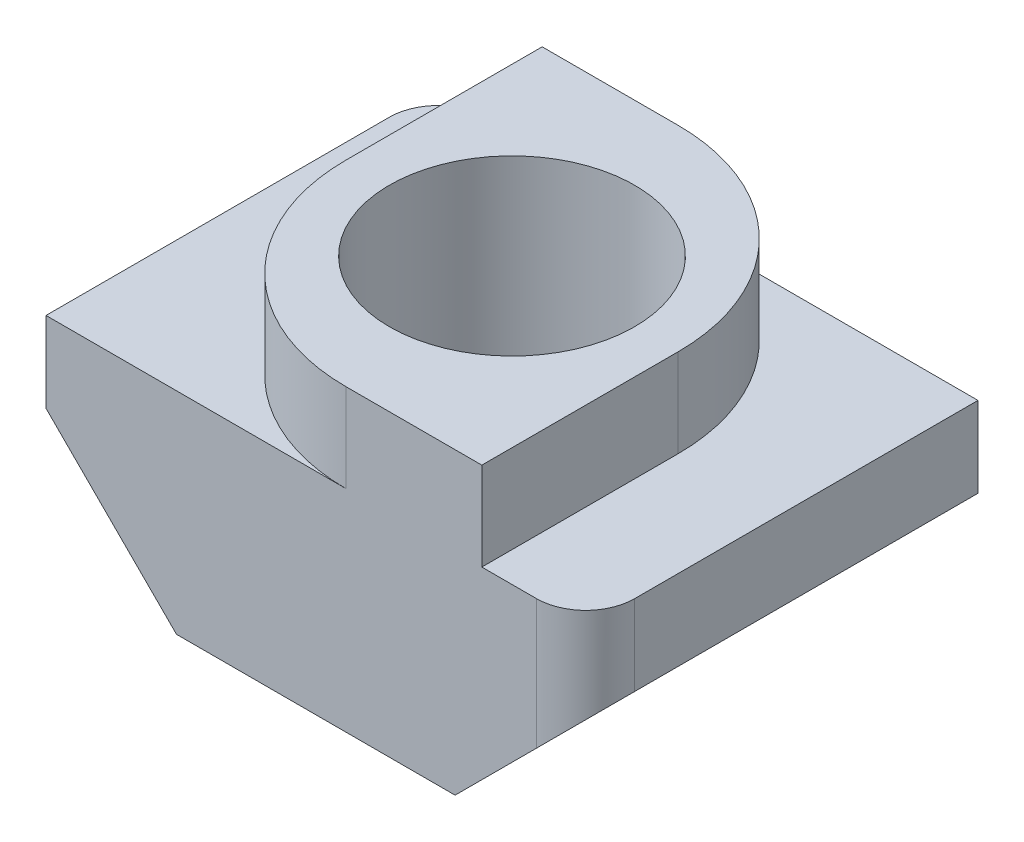
ISO-10303-21;
HEADER;
FILE_DESCRIPTION(('STEP AP214'),'2;1');
FILE_NAME('part.step','',(''),(''),'','','');
FILE_SCHEMA(('AUTOMOTIVE_DESIGN { 1 0 10303 214 1 1 1 1 }'));
ENDSEC;
DATA;
#1=APPLICATION_CONTEXT('core data for automotive mechanical design processes');
#2=APPLICATION_PROTOCOL_DEFINITION('international standard','automotive_design',2000,#1);
#3=PRODUCT_CONTEXT('',#1,'mechanical');
#4=PRODUCT('Part','Part','',(#3));
#5=PRODUCT_RELATED_PRODUCT_CATEGORY('part','',(#4));
#6=PRODUCT_DEFINITION_FORMATION('','',#4);
#7=PRODUCT_DEFINITION_CONTEXT('part definition',#1,'design');
#8=PRODUCT_DEFINITION('design','',#6,#7);
#9=PRODUCT_DEFINITION_SHAPE('','',#8);
#10=(LENGTH_UNIT() NAMED_UNIT(*) SI_UNIT(.MILLI.,.METRE.));
#11=(NAMED_UNIT(*) PLANE_ANGLE_UNIT() SI_UNIT($,.RADIAN.));
#12=(NAMED_UNIT(*) SI_UNIT($,.STERADIAN.) SOLID_ANGLE_UNIT());
#13=UNCERTAINTY_MEASURE_WITH_UNIT(LENGTH_MEASURE(1.E-05),#10,'distance_accuracy_value','');
#14=(GEOMETRIC_REPRESENTATION_CONTEXT(3) GLOBAL_UNCERTAINTY_ASSIGNED_CONTEXT((#13)) GLOBAL_UNIT_ASSIGNED_CONTEXT((#10,
#11,#12)) REPRESENTATION_CONTEXT('',''));
#15=CARTESIAN_POINT('',(0.,0.,0.));
#16=DIRECTION('',(0.,0.,1.));
#17=DIRECTION('',(1.,0.,0.));
#18=AXIS2_PLACEMENT_3D('',#15,#16,#17);
#19=CARTESIAN_POINT('',(0.,4.3,0.));
#20=DIRECTION('',(0.,-1.,0.));
#21=DIRECTION('',(0.,0.,-1.));
#22=AXIS2_PLACEMENT_3D('',#19,#20,#21);
#23=PLANE('',#22);
#24=DIRECTION('',(1.,0.,0.));
#25=VECTOR('',#24,1.);
#26=CARTESIAN_POINT('',(-5.5,4.3,4.));
#27=LINE('',#26,#25);
#28=CARTESIAN_POINT('',(3.385,4.3,4.));
#29=VERTEX_POINT('',#28);
#30=CARTESIAN_POINT('',(4.5,4.3,4.));
#31=VERTEX_POINT('',#30);
#32=EDGE_CURVE('E256',#29,#31,#27,.T.);
#33=ORIENTED_EDGE('',*,*,#32,.T.);
#34=CARTESIAN_POINT('',(4.5,4.3,3.));
#35=DIRECTION('',(0.,-1.,0.));
#36=DIRECTION('',(0.,0.,-1.));
#37=AXIS2_PLACEMENT_3D('',#34,#35,#36);
#38=CIRCLE('',#37,1.);
#39=CARTESIAN_POINT('',(5.5,4.3,3.));
#40=VERTEX_POINT('',#39);
#41=EDGE_CURVE('E204',#31,#40,#38,.F.);
#42=ORIENTED_EDGE('',*,*,#41,.T.);
#43=DIRECTION('',(0.,0.,-1.));
#44=VECTOR('',#43,1.);
#45=CARTESIAN_POINT('',(5.5,4.3,4.));
#46=LINE('',#45,#44);
#47=CARTESIAN_POINT('',(5.5,4.3,-4.));
#48=VERTEX_POINT('',#47);
#49=EDGE_CURVE('E234',#40,#48,#46,.T.);
#50=ORIENTED_EDGE('',*,*,#49,.T.);
#51=DIRECTION('',(-1.,0.,0.));
#52=VECTOR('',#51,1.);
#53=CARTESIAN_POINT('',(-5.5,4.3,-4.));
#54=LINE('',#53,#52);
#55=CARTESIAN_POINT('',(-0.615,4.3,-4.));
#56=VERTEX_POINT('',#55);
#57=EDGE_CURVE('E244',#48,#56,#54,.T.);
#58=ORIENTED_EDGE('',*,*,#57,.T.);
#59=CARTESIAN_POINT('',(-0.615,4.3,0.));
#60=DIRECTION('',(0.,-1.,0.));
#61=DIRECTION('',(0.,0.,-1.));
#62=AXIS2_PLACEMENT_3D('',#59,#60,#61);
#63=CIRCLE('',#62,4.);
#64=CARTESIAN_POINT('',(3.385,4.3,0.));
#65=VERTEX_POINT('',#64);
#66=EDGE_CURVE('E193',#56,#65,#63,.T.);
#67=ORIENTED_EDGE('',*,*,#66,.T.);
#68=DIRECTION('',(0.,0.,-1.));
#69=VECTOR('',#68,1.);
#70=CARTESIAN_POINT('',(3.385,4.3,4.));
#71=LINE('',#70,#69);
#72=EDGE_CURVE('E170',#29,#65,#71,.T.);
#73=ORIENTED_EDGE('',*,*,#72,.F.);
#74=EDGE_LOOP('',(#33,#42,#50,#58,#67,#73));
#75=FACE_BOUND('',#74,.T.);
#76=ADVANCED_FACE('F33',(#75),#23,.F.);
#77=CARTESIAN_POINT('',(-3.385,4.3,-4.));
#78=VERTEX_POINT('',#77);
#79=CARTESIAN_POINT('',(-4.5,4.3,-4.));
#80=VERTEX_POINT('',#79);
#81=EDGE_CURVE('E151',#78,#80,#54,.T.);
#82=ORIENTED_EDGE('',*,*,#81,.T.);
#83=CARTESIAN_POINT('',(-4.5,4.3,-3.));
#84=DIRECTION('',(0.,-1.,0.));
#85=DIRECTION('',(0.,0.,-1.));
#86=AXIS2_PLACEMENT_3D('',#83,#84,#85);
#87=CIRCLE('',#86,1.);
#88=CARTESIAN_POINT('',(-5.5,4.3,-3.));
#89=VERTEX_POINT('',#88);
#90=EDGE_CURVE('E11',#80,#89,#87,.F.);
#91=ORIENTED_EDGE('',*,*,#90,.T.);
#92=DIRECTION('',(0.,0.,1.));
#93=VECTOR('',#92,1.);
#94=CARTESIAN_POINT('',(-5.5,4.3,4.));
#95=LINE('',#94,#93);
#96=CARTESIAN_POINT('',(-5.5,4.3,4.));
#97=VERTEX_POINT('',#96);
#98=EDGE_CURVE('E216',#89,#97,#95,.T.);
#99=ORIENTED_EDGE('',*,*,#98,.T.);
#100=CARTESIAN_POINT('',(0.615,4.3,4.));
#101=VERTEX_POINT('',#100);
#102=EDGE_CURVE('E250',#97,#101,#27,.T.);
#103=ORIENTED_EDGE('',*,*,#102,.T.);
#104=CARTESIAN_POINT('',(0.615,4.3,0.));
#105=DIRECTION('',(0.,-1.,0.));
#106=DIRECTION('',(0.,0.,-1.));
#107=AXIS2_PLACEMENT_3D('',#104,#105,#106);
#108=CIRCLE('',#107,4.);
#109=CARTESIAN_POINT('',(-3.385,4.3,0.));
#110=VERTEX_POINT('',#109);
#111=EDGE_CURVE('E195',#101,#110,#108,.T.);
#112=ORIENTED_EDGE('',*,*,#111,.T.);
#113=DIRECTION('',(0.,0.,1.));
#114=VECTOR('',#113,1.);
#115=CARTESIAN_POINT('',(-3.385,4.3,4.));
#116=LINE('',#115,#114);
#117=EDGE_CURVE('E174',#78,#110,#116,.T.);
#118=ORIENTED_EDGE('',*,*,#117,.F.);
#119=EDGE_LOOP('',(#82,#91,#99,#103,#112,#118));
#120=FACE_BOUND('',#119,.T.);
#121=ADVANCED_FACE('F265',(#120),#23,.F.);
#122=CARTESIAN_POINT('',(0.,0.,0.));
#123=DIRECTION('',(0.,-1.,0.));
#124=DIRECTION('',(0.,0.,-1.));
#125=AXIS2_PLACEMENT_3D('',#122,#123,#124);
#126=PLANE('',#125);
#127=DIRECTION('',(0.,0.,1.));
#128=VECTOR('',#127,1.);
#129=CARTESIAN_POINT('',(2.84000000000001,0.,-4.));
#130=LINE('',#129,#128);
#131=CARTESIAN_POINT('',(2.84000000000001,0.,-4.));
#132=VERTEX_POINT('',#131);
#133=CARTESIAN_POINT('',(2.84000000000001,0.,4.));
#134=VERTEX_POINT('',#133);
#135=EDGE_CURVE('E342',#132,#134,#130,.T.);
#136=ORIENTED_EDGE('',*,*,#135,.T.);
#137=DIRECTION('',(1.,0.,0.));
#138=VECTOR('',#137,1.);
#139=CARTESIAN_POINT('',(-5.5,0.,4.));
#140=LINE('',#139,#138);
#141=CARTESIAN_POINT('',(-2.84000000000001,0.,4.));
#142=VERTEX_POINT('',#141);
#143=EDGE_CURVE('E236',#142,#134,#140,.T.);
#144=ORIENTED_EDGE('',*,*,#143,.F.);
#145=DIRECTION('',(0.,0.,1.));
#146=VECTOR('',#145,1.);
#147=CARTESIAN_POINT('',(-2.84000000000001,0.,-4.));
#148=LINE('',#147,#146);
#149=CARTESIAN_POINT('',(-2.84000000000001,0.,-4.));
#150=VERTEX_POINT('',#149);
#151=EDGE_CURVE('E224',#150,#142,#148,.T.);
#152=ORIENTED_EDGE('',*,*,#151,.F.);
#153=DIRECTION('',(-1.,0.,0.));
#154=VECTOR('',#153,1.);
#155=CARTESIAN_POINT('',(-5.5,0.,-4.));
#156=LINE('',#155,#154);
#157=EDGE_CURVE('E227',#132,#150,#156,.T.);
#158=ORIENTED_EDGE('',*,*,#157,.F.);
#159=EDGE_LOOP('',(#136,#144,#152,#158));
#160=FACE_BOUND('',#159,.T.);
#161=CARTESIAN_POINT('',(0.,0.,0.));
#162=DIRECTION('',(0.,1.,0.));
#163=DIRECTION('',(0.,0.,1.));
#164=AXIS2_PLACEMENT_3D('',#161,#162,#163);
#165=CIRCLE('',#164,2.5);
#166=CARTESIAN_POINT('',(0.,0.,2.5));
#167=VERTEX_POINT('',#166);
#168=EDGE_CURVE('E223',#167,#167,#165,.T.);
#169=ORIENTED_EDGE('',*,*,#168,.T.);
#170=EDGE_LOOP('',(#169));
#171=FACE_BOUND('',#170,.T.);
#172=ADVANCED_FACE('F298',(#160,#171),#126,.T.);
#173=CARTESIAN_POINT('',(5.5,4.3,4.));
#174=DIRECTION('',(-1.,0.,0.));
#175=DIRECTION('',(0.,0.,1.));
#176=AXIS2_PLACEMENT_3D('',#173,#174,#175);
#177=PLANE('',#176);
#178=ORIENTED_EDGE('',*,*,#49,.F.);
#179=DIRECTION('',(0.,-1.,0.));
#180=VECTOR('',#179,1.);
#181=CARTESIAN_POINT('',(5.5,4.3,3.));
#182=LINE('',#181,#180);
#183=CARTESIAN_POINT('',(5.5,2.66,3.));
#184=VERTEX_POINT('',#183);
#185=EDGE_CURVE('E197',#40,#184,#182,.T.);
#186=ORIENTED_EDGE('',*,*,#185,.T.);
#187=DIRECTION('',(0.,0.,1.));
#188=VECTOR('',#187,1.);
#189=CARTESIAN_POINT('',(5.5,2.66,-4.));
#190=LINE('',#189,#188);
#191=CARTESIAN_POINT('',(5.5,2.66,-4.));
#192=VERTEX_POINT('',#191);
#193=EDGE_CURVE('E333',#192,#184,#190,.T.);
#194=ORIENTED_EDGE('',*,*,#193,.F.);
#195=DIRECTION('',(0.,-1.,0.));
#196=VECTOR('',#195,1.);
#197=CARTESIAN_POINT('',(5.5,4.3,-4.));
#198=LINE('',#197,#196);
#199=EDGE_CURVE('E184',#48,#192,#198,.T.);
#200=ORIENTED_EDGE('',*,*,#199,.F.);
#201=EDGE_LOOP('',(#178,#186,#194,#200));
#202=FACE_BOUND('',#201,.T.);
#203=ADVANCED_FACE('F304',(#202),#177,.F.);
#204=CARTESIAN_POINT('',(-5.5,4.3,-4.));
#205=DIRECTION('',(0.,0.,1.));
#206=DIRECTION('',(1.,0.,0.));
#207=AXIS2_PLACEMENT_3D('',#204,#205,#206);
#208=PLANE('',#207);
#209=DIRECTION('',(-0.707106781186546,0.707106781186549,0.));
#210=VECTOR('',#209,1.);
#211=CARTESIAN_POINT('',(-5.5,2.66,-4.));
#212=LINE('',#211,#210);
#213=CARTESIAN_POINT('',(-4.5,1.66,-4.));
#214=VERTEX_POINT('',#213);
#215=EDGE_CURVE('E229',#150,#214,#212,.T.);
#216=ORIENTED_EDGE('',*,*,#215,.T.);
#217=DIRECTION('',(0.,-1.,0.));
#218=VECTOR('',#217,1.);
#219=CARTESIAN_POINT('',(-4.5,4.3,-4.));
#220=LINE('',#219,#218);
#221=EDGE_CURVE('E41',#214,#80,#220,.F.);
#222=ORIENTED_EDGE('',*,*,#221,.T.);
#223=ORIENTED_EDGE('',*,*,#81,.F.);
#224=DIRECTION('',(0.,-1.,0.));
#225=VECTOR('',#224,1.);
#226=CARTESIAN_POINT('',(-3.385,6.1,-4.));
#227=LINE('',#226,#225);
#228=CARTESIAN_POINT('',(-3.385,6.1,-4.));
#229=VERTEX_POINT('',#228);
#230=EDGE_CURVE('E149',#229,#78,#227,.T.);
#231=ORIENTED_EDGE('',*,*,#230,.F.);
#232=DIRECTION('',(-1.,0.,0.));
#233=VECTOR('',#232,1.);
#234=CARTESIAN_POINT('',(-3.385,6.1,-4.));
#235=LINE('',#234,#233);
#236=CARTESIAN_POINT('',(-0.615,6.1,-4.));
#237=VERTEX_POINT('',#236);
#238=EDGE_CURVE('E134',#237,#229,#235,.T.);
#239=ORIENTED_EDGE('',*,*,#238,.F.);
#240=DIRECTION('',(0.,-1.,0.));
#241=VECTOR('',#240,1.);
#242=CARTESIAN_POINT('',(-0.615,4.3,-4.));
#243=LINE('',#242,#241);
#244=EDGE_CURVE('E181',#237,#56,#243,.T.);
#245=ORIENTED_EDGE('',*,*,#244,.T.);
#246=ORIENTED_EDGE('',*,*,#57,.F.);
#247=ORIENTED_EDGE('',*,*,#199,.T.);
#248=DIRECTION('',(-0.707106781186547,-0.707106781186548,0.));
#249=VECTOR('',#248,1.);
#250=CARTESIAN_POINT('',(5.5,2.66,-4.));
#251=LINE('',#250,#249);
#252=EDGE_CURVE('E335',#192,#132,#251,.T.);
#253=ORIENTED_EDGE('',*,*,#252,.T.);
#254=ORIENTED_EDGE('',*,*,#157,.T.);
#255=EDGE_LOOP('',(#216,#222,#223,#231,#239,#245,#246,#247,#253,#254));
#256=FACE_BOUND('',#255,.T.);
#257=ADVANCED_FACE('F150',(#256),#208,.F.);
#258=CARTESIAN_POINT('',(-5.5,4.3,4.));
#259=DIRECTION('',(1.,0.,0.));
#260=DIRECTION('',(0.,0.,-1.));
#261=AXIS2_PLACEMENT_3D('',#258,#259,#260);
#262=PLANE('',#261);
#263=ORIENTED_EDGE('',*,*,#98,.F.);
#264=DIRECTION('',(0.,-1.,0.));
#265=VECTOR('',#264,1.);
#266=CARTESIAN_POINT('',(-5.5,4.3,-3.));
#267=LINE('',#266,#265);
#268=CARTESIAN_POINT('',(-5.5,2.66,-3.));
#269=VERTEX_POINT('',#268);
#270=EDGE_CURVE('E206',#89,#269,#267,.T.);
#271=ORIENTED_EDGE('',*,*,#270,.T.);
#272=DIRECTION('',(0.,0.,1.));
#273=VECTOR('',#272,1.);
#274=CARTESIAN_POINT('',(-5.5,2.66,-4.));
#275=LINE('',#274,#273);
#276=CARTESIAN_POINT('',(-5.5,2.66,4.));
#277=VERTEX_POINT('',#276);
#278=EDGE_CURVE('E214',#269,#277,#275,.T.);
#279=ORIENTED_EDGE('',*,*,#278,.T.);
#280=DIRECTION('',(0.,-1.,0.));
#281=VECTOR('',#280,1.);
#282=CARTESIAN_POINT('',(-5.5,4.3,4.));
#283=LINE('',#282,#281);
#284=EDGE_CURVE('E248',#97,#277,#283,.T.);
#285=ORIENTED_EDGE('',*,*,#284,.F.);
#286=EDGE_LOOP('',(#263,#271,#279,#285));
#287=FACE_BOUND('',#286,.T.);
#288=ADVANCED_FACE('F212',(#287),#262,.F.);
#289=CARTESIAN_POINT('',(-5.5,4.3,4.));
#290=DIRECTION('',(0.,0.,-1.));
#291=DIRECTION('',(-1.,0.,0.));
#292=AXIS2_PLACEMENT_3D('',#289,#290,#291);
#293=PLANE('',#292);
#294=DIRECTION('',(-0.707106781186547,-0.707106781186548,0.));
#295=VECTOR('',#294,1.);
#296=CARTESIAN_POINT('',(5.5,2.66,4.));
#297=LINE('',#296,#295);
#298=CARTESIAN_POINT('',(4.5,1.66,4.));
#299=VERTEX_POINT('',#298);
#300=EDGE_CURVE('E154',#299,#134,#297,.T.);
#301=ORIENTED_EDGE('',*,*,#300,.F.);
#302=DIRECTION('',(0.,-1.,0.));
#303=VECTOR('',#302,1.);
#304=CARTESIAN_POINT('',(4.5,4.3,4.));
#305=LINE('',#304,#303);
#306=EDGE_CURVE('E202',#299,#31,#305,.F.);
#307=ORIENTED_EDGE('',*,*,#306,.T.);
#308=ORIENTED_EDGE('',*,*,#32,.F.);
#309=DIRECTION('',(0.,-1.,0.));
#310=VECTOR('',#309,1.);
#311=CARTESIAN_POINT('',(3.385,6.1,4.));
#312=LINE('',#311,#310);
#313=CARTESIAN_POINT('',(3.385,6.1,4.));
#314=VERTEX_POINT('',#313);
#315=EDGE_CURVE('E155',#314,#29,#312,.T.);
#316=ORIENTED_EDGE('',*,*,#315,.F.);
#317=DIRECTION('',(1.,0.,0.));
#318=VECTOR('',#317,1.);
#319=CARTESIAN_POINT('',(-3.385,6.1,4.));
#320=LINE('',#319,#318);
#321=CARTESIAN_POINT('',(0.615,6.1,4.));
#322=VERTEX_POINT('',#321);
#323=EDGE_CURVE('E160',#322,#314,#320,.T.);
#324=ORIENTED_EDGE('',*,*,#323,.F.);
#325=DIRECTION('',(0.,-1.,0.));
#326=VECTOR('',#325,1.);
#327=CARTESIAN_POINT('',(0.615,4.3,4.));
#328=LINE('',#327,#326);
#329=EDGE_CURVE('E189',#322,#101,#328,.T.);
#330=ORIENTED_EDGE('',*,*,#329,.T.);
#331=ORIENTED_EDGE('',*,*,#102,.F.);
#332=ORIENTED_EDGE('',*,*,#284,.T.);
#333=DIRECTION('',(-0.707106781186546,0.707106781186549,0.));
#334=VECTOR('',#333,1.);
#335=CARTESIAN_POINT('',(-5.5,2.66,4.));
#336=LINE('',#335,#334);
#337=EDGE_CURVE('E221',#142,#277,#336,.T.);
#338=ORIENTED_EDGE('',*,*,#337,.F.);
#339=ORIENTED_EDGE('',*,*,#143,.T.);
#340=EDGE_LOOP('',(#301,#307,#308,#316,#324,#330,#331,#332,#338,#339));
#341=FACE_BOUND('',#340,.T.);
#342=ADVANCED_FACE('F268',(#341),#293,.F.);
#343=CARTESIAN_POINT('',(0.,4.3,0.));
#344=DIRECTION('',(0.,-1.,0.));
#345=DIRECTION('',(0.,0.,-1.));
#346=AXIS2_PLACEMENT_3D('',#343,#344,#345);
#347=CYLINDRICAL_SURFACE('',#346,2.5);
#348=ORIENTED_EDGE('',*,*,#168,.F.);
#349=EDGE_LOOP('',(#348));
#350=FACE_BOUND('',#349,.T.);
#351=CARTESIAN_POINT('',(0.,6.1,0.));
#352=DIRECTION('',(0.,1.,0.));
#353=DIRECTION('',(0.,0.,1.));
#354=AXIS2_PLACEMENT_3D('',#351,#352,#353);
#355=CIRCLE('',#354,2.5);
#356=CARTESIAN_POINT('',(0.,6.1,2.5));
#357=VERTEX_POINT('',#356);
#358=EDGE_CURVE('E175',#357,#357,#355,.T.);
#359=ORIENTED_EDGE('',*,*,#358,.T.);
#360=EDGE_LOOP('',(#359));
#361=FACE_BOUND('',#360,.T.);
#362=ADVANCED_FACE('F279',(#350,#361),#347,.F.);
#363=CARTESIAN_POINT('',(-5.5,2.66,-4.));
#364=DIRECTION('',(0.707106781186549,0.707106781186546,0.));
#365=DIRECTION('',(-0.707106781186546,0.707106781186549,0.));
#366=AXIS2_PLACEMENT_3D('',#363,#364,#365);
#367=PLANE('',#366);
#368=ORIENTED_EDGE('',*,*,#278,.F.);
#369=CARTESIAN_POINT('',(-4.5,1.66,-3.));
#370=DIRECTION('',(0.707106781186549,0.707106781186546,0.));
#371=DIRECTION('',(0.707106781186546,-0.707106781186549,0.));
#372=AXIS2_PLACEMENT_3D('',#369,#370,#371);
#373=ELLIPSE('',#372,1.4142135623731,1.);
#374=EDGE_CURVE('E55',#269,#214,#373,.F.);
#375=ORIENTED_EDGE('',*,*,#374,.T.);
#376=ORIENTED_EDGE('',*,*,#215,.F.);
#377=ORIENTED_EDGE('',*,*,#151,.T.);
#378=ORIENTED_EDGE('',*,*,#337,.T.);
#379=EDGE_LOOP('',(#368,#375,#376,#377,#378));
#380=FACE_BOUND('',#379,.T.);
#381=ADVANCED_FACE('F219',(#380),#367,.F.);
#382=CARTESIAN_POINT('',(5.5,2.66,-4.));
#383=DIRECTION('',(-0.707106781186549,0.707106781186547,0.));
#384=DIRECTION('',(-0.707106781186547,-0.707106781186549,0.));
#385=AXIS2_PLACEMENT_3D('',#382,#383,#384);
#386=PLANE('',#385);
#387=ORIENTED_EDGE('',*,*,#193,.T.);
#388=CARTESIAN_POINT('',(4.5,1.66,3.));
#389=DIRECTION('',(-0.707106781186549,0.707106781186547,0.));
#390=DIRECTION('',(-0.707106781186547,-0.707106781186549,0.));
#391=AXIS2_PLACEMENT_3D('',#388,#389,#390);
#392=ELLIPSE('',#391,1.4142135623731,1.);
#393=EDGE_CURVE('E200',#184,#299,#392,.F.);
#394=ORIENTED_EDGE('',*,*,#393,.T.);
#395=ORIENTED_EDGE('',*,*,#300,.T.);
#396=ORIENTED_EDGE('',*,*,#135,.F.);
#397=ORIENTED_EDGE('',*,*,#252,.F.);
#398=EDGE_LOOP('',(#387,#394,#395,#396,#397));
#399=FACE_BOUND('',#398,.T.);
#400=ADVANCED_FACE('F282',(#399),#386,.F.);
#401=CARTESIAN_POINT('',(0.,6.1,0.));
#402=DIRECTION('',(0.,-1.,0.));
#403=DIRECTION('',(0.,0.,-1.));
#404=AXIS2_PLACEMENT_3D('',#401,#402,#403);
#405=PLANE('',#404);
#406=DIRECTION('',(0.,0.,-1.));
#407=VECTOR('',#406,1.);
#408=CARTESIAN_POINT('',(3.385,6.1,4.));
#409=LINE('',#408,#407);
#410=CARTESIAN_POINT('',(3.385,6.1,0.));
#411=VERTEX_POINT('',#410);
#412=EDGE_CURVE('E146',#314,#411,#409,.T.);
#413=ORIENTED_EDGE('',*,*,#412,.T.);
#414=CARTESIAN_POINT('',(-0.615,6.1,0.));
#415=DIRECTION('',(0.,-1.,0.));
#416=DIRECTION('',(0.,0.,-1.));
#417=AXIS2_PLACEMENT_3D('',#414,#415,#416);
#418=CIRCLE('',#417,4.);
#419=EDGE_CURVE('E143',#411,#237,#418,.F.);
#420=ORIENTED_EDGE('',*,*,#419,.T.);
#421=ORIENTED_EDGE('',*,*,#238,.T.);
#422=DIRECTION('',(0.,0.,1.));
#423=VECTOR('',#422,1.);
#424=CARTESIAN_POINT('',(-3.385,6.1,4.));
#425=LINE('',#424,#423);
#426=CARTESIAN_POINT('',(-3.385,6.1,0.));
#427=VERTEX_POINT('',#426);
#428=EDGE_CURVE('E140',#229,#427,#425,.T.);
#429=ORIENTED_EDGE('',*,*,#428,.T.);
#430=CARTESIAN_POINT('',(0.615,6.1,0.));
#431=DIRECTION('',(0.,-1.,0.));
#432=DIRECTION('',(0.,0.,-1.));
#433=AXIS2_PLACEMENT_3D('',#430,#431,#432);
#434=CIRCLE('',#433,4.);
#435=EDGE_CURVE('E186',#427,#322,#434,.F.);
#436=ORIENTED_EDGE('',*,*,#435,.T.);
#437=ORIENTED_EDGE('',*,*,#323,.T.);
#438=EDGE_LOOP('',(#413,#420,#421,#429,#436,#437));
#439=FACE_BOUND('',#438,.T.);
#440=ORIENTED_EDGE('',*,*,#358,.F.);
#441=EDGE_LOOP('',(#440));
#442=FACE_BOUND('',#441,.T.);
#443=ADVANCED_FACE('F137',(#439,#442),#405,.F.);
#444=CARTESIAN_POINT('',(3.385,6.1,4.));
#445=DIRECTION('',(-1.,0.,0.));
#446=DIRECTION('',(0.,0.,1.));
#447=AXIS2_PLACEMENT_3D('',#444,#445,#446);
#448=PLANE('',#447);
#449=ORIENTED_EDGE('',*,*,#72,.T.);
#450=DIRECTION('',(0.,-1.,0.));
#451=VECTOR('',#450,1.);
#452=CARTESIAN_POINT('',(3.385,6.1,0.));
#453=LINE('',#452,#451);
#454=EDGE_CURVE('E183',#65,#411,#453,.F.);
#455=ORIENTED_EDGE('',*,*,#454,.T.);
#456=ORIENTED_EDGE('',*,*,#412,.F.);
#457=ORIENTED_EDGE('',*,*,#315,.T.);
#458=EDGE_LOOP('',(#449,#455,#456,#457));
#459=FACE_BOUND('',#458,.T.);
#460=ADVANCED_FACE('F281',(#459),#448,.F.);
#461=CARTESIAN_POINT('',(-3.385,6.1,4.));
#462=DIRECTION('',(1.,0.,0.));
#463=DIRECTION('',(0.,0.,-1.));
#464=AXIS2_PLACEMENT_3D('',#461,#462,#463);
#465=PLANE('',#464);
#466=ORIENTED_EDGE('',*,*,#117,.T.);
#467=DIRECTION('',(0.,-1.,0.));
#468=VECTOR('',#467,1.);
#469=CARTESIAN_POINT('',(-3.385,6.1,0.));
#470=LINE('',#469,#468);
#471=EDGE_CURVE('E159',#110,#427,#470,.F.);
#472=ORIENTED_EDGE('',*,*,#471,.T.);
#473=ORIENTED_EDGE('',*,*,#428,.F.);
#474=ORIENTED_EDGE('',*,*,#230,.T.);
#475=EDGE_LOOP('',(#466,#472,#473,#474));
#476=FACE_BOUND('',#475,.T.);
#477=ADVANCED_FACE('F157',(#476),#465,.F.);
#478=CARTESIAN_POINT('',(-0.615,4.3,0.));
#479=DIRECTION('',(0.,-1.,0.));
#480=DIRECTION('',(0.,0.,-1.));
#481=AXIS2_PLACEMENT_3D('',#478,#479,#480);
#482=CYLINDRICAL_SURFACE('',#481,4.);
#483=ORIENTED_EDGE('',*,*,#419,.F.);
#484=ORIENTED_EDGE('',*,*,#454,.F.);
#485=ORIENTED_EDGE('',*,*,#66,.F.);
#486=ORIENTED_EDGE('',*,*,#244,.F.);
#487=EDGE_LOOP('',(#483,#484,#485,#486));
#488=FACE_BOUND('',#487,.T.);
#489=ADVANCED_FACE('F315',(#488),#482,.T.);
#490=CARTESIAN_POINT('',(0.615,4.3,0.));
#491=DIRECTION('',(0.,-1.,0.));
#492=DIRECTION('',(0.,0.,-1.));
#493=AXIS2_PLACEMENT_3D('',#490,#491,#492);
#494=CYLINDRICAL_SURFACE('',#493,4.);
#495=ORIENTED_EDGE('',*,*,#435,.F.);
#496=ORIENTED_EDGE('',*,*,#471,.F.);
#497=ORIENTED_EDGE('',*,*,#111,.F.);
#498=ORIENTED_EDGE('',*,*,#329,.F.);
#499=EDGE_LOOP('',(#495,#496,#497,#498));
#500=FACE_BOUND('',#499,.T.);
#501=ADVANCED_FACE('F273',(#500),#494,.T.);
#502=CARTESIAN_POINT('',(4.5,4.3,3.));
#503=DIRECTION('',(0.,-1.,0.));
#504=DIRECTION('',(0.,0.,-1.));
#505=AXIS2_PLACEMENT_3D('',#502,#503,#504);
#506=CYLINDRICAL_SURFACE('',#505,1.);
#507=ORIENTED_EDGE('',*,*,#41,.F.);
#508=ORIENTED_EDGE('',*,*,#306,.F.);
#509=ORIENTED_EDGE('',*,*,#393,.F.);
#510=ORIENTED_EDGE('',*,*,#185,.F.);
#511=EDGE_LOOP('',(#507,#508,#509,#510));
#512=FACE_BOUND('',#511,.T.);
#513=ADVANCED_FACE('F320',(#512),#506,.T.);
#514=CARTESIAN_POINT('',(-4.5,4.3,-3.));
#515=DIRECTION('',(0.,-1.,0.));
#516=DIRECTION('',(0.,0.,-1.));
#517=AXIS2_PLACEMENT_3D('',#514,#515,#516);
#518=CYLINDRICAL_SURFACE('',#517,1.);
#519=ORIENTED_EDGE('',*,*,#90,.F.);
#520=ORIENTED_EDGE('',*,*,#221,.F.);
#521=ORIENTED_EDGE('',*,*,#374,.F.);
#522=ORIENTED_EDGE('',*,*,#270,.F.);
#523=EDGE_LOOP('',(#519,#520,#521,#522));
#524=FACE_BOUND('',#523,.T.);
#525=ADVANCED_FACE('F35',(#524),#518,.T.);
#526=CLOSED_SHELL('',(#76,#121,#172,#203,#257,#288,#342,#362,#381,#400,#443,#460,#477,#489,#501,
#513,#525));
#527=MANIFOLD_SOLID_BREP('B2',#526);
#528=ADVANCED_BREP_SHAPE_REPRESENTATION('',(#18,#527),#14);
#529=SHAPE_DEFINITION_REPRESENTATION(#9,#528);
ENDSEC;
END-ISO-10303-21;
